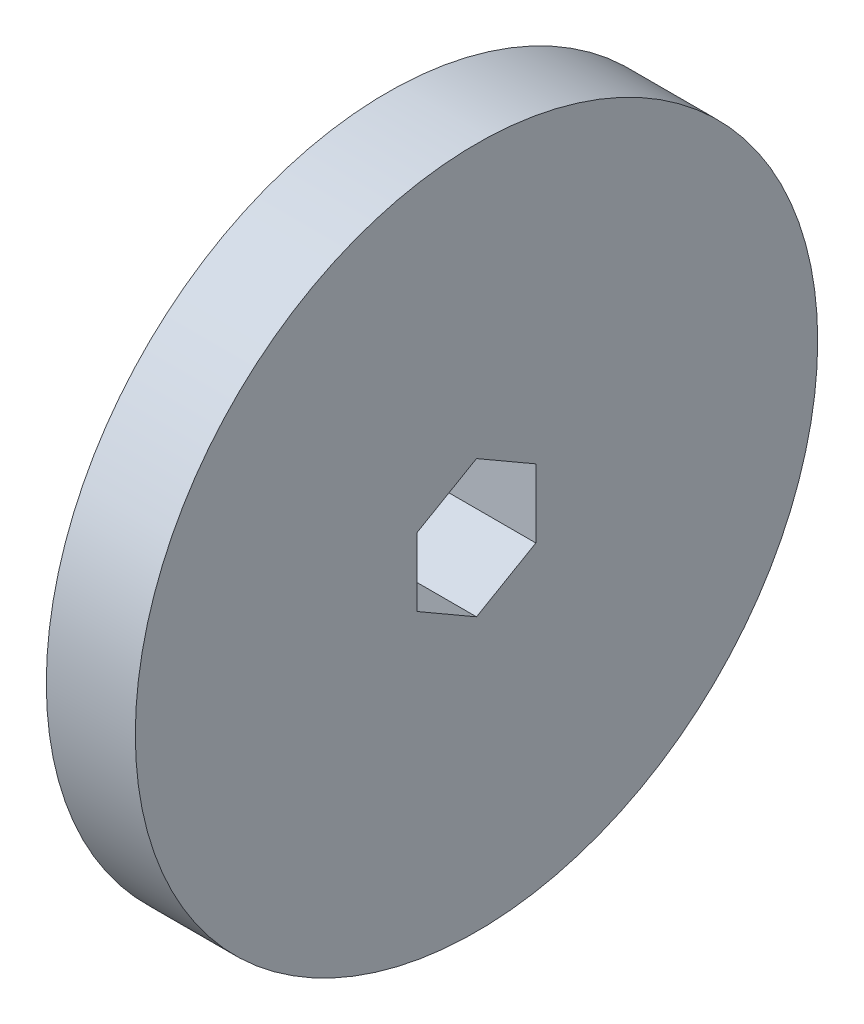
ISO-10303-21;
HEADER;
FILE_DESCRIPTION(('STEP AP214'),'2;1');
FILE_NAME('part.step','',(''),(''),'','','');
FILE_SCHEMA(('AUTOMOTIVE_DESIGN { 1 0 10303 214 1 1 1 1 }'));
ENDSEC;
DATA;
#1=APPLICATION_CONTEXT('core data for automotive mechanical design processes');
#2=APPLICATION_PROTOCOL_DEFINITION('international standard','automotive_design',2000,#1);
#3=PRODUCT_CONTEXT('',#1,'mechanical');
#4=PRODUCT('Part','Part','',(#3));
#5=PRODUCT_RELATED_PRODUCT_CATEGORY('part','',(#4));
#6=PRODUCT_DEFINITION_FORMATION('','',#4);
#7=PRODUCT_DEFINITION_CONTEXT('part definition',#1,'design');
#8=PRODUCT_DEFINITION('design','',#6,#7);
#9=PRODUCT_DEFINITION_SHAPE('','',#8);
#10=(LENGTH_UNIT() NAMED_UNIT(*) SI_UNIT(.MILLI.,.METRE.));
#11=(NAMED_UNIT(*) PLANE_ANGLE_UNIT() SI_UNIT($,.RADIAN.));
#12=(NAMED_UNIT(*) SI_UNIT($,.STERADIAN.) SOLID_ANGLE_UNIT());
#13=UNCERTAINTY_MEASURE_WITH_UNIT(LENGTH_MEASURE(1.E-05),#10,'distance_accuracy_value','');
#14=(GEOMETRIC_REPRESENTATION_CONTEXT(3) GLOBAL_UNCERTAINTY_ASSIGNED_CONTEXT((#13)) GLOBAL_UNIT_ASSIGNED_CONTEXT((#10,
#11,#12)) REPRESENTATION_CONTEXT('',''));
#15=CARTESIAN_POINT('',(0.,0.,0.));
#16=DIRECTION('',(0.,0.,1.));
#17=DIRECTION('',(1.,0.,0.));
#18=AXIS2_PLACEMENT_3D('',#15,#16,#17);
#19=CARTESIAN_POINT('',(4.7625,0.,0.));
#20=DIRECTION('',(1.,0.,0.));
#21=DIRECTION('',(0.,0.,-1.));
#22=AXIS2_PLACEMENT_3D('',#19,#20,#21);
#23=PLANE('',#22);
#24=CARTESIAN_POINT('',(4.7625,0.,0.));
#25=DIRECTION('',(1.,0.,0.));
#26=DIRECTION('',(0.,0.,-1.));
#27=AXIS2_PLACEMENT_3D('',#24,#25,#26);
#28=CIRCLE('',#27,36.5125);
#29=CARTESIAN_POINT('',(4.7625,0.,-36.5125));
#30=VERTEX_POINT('',#29);
#31=EDGE_CURVE('E11',#30,#30,#28,.T.);
#32=ORIENTED_EDGE('',*,*,#31,.T.);
#33=EDGE_LOOP('',(#32));
#34=FACE_BOUND('',#33,.T.);
#35=DIRECTION('',(0.,-0.5,0.866025403784439));
#36=VECTOR('',#35,1.);
#37=CARTESIAN_POINT('',(4.7625,7.33234841870825,0.));
#38=LINE('',#37,#36);
#39=CARTESIAN_POINT('',(4.7625,7.33234841870825,0.));
#40=VERTEX_POINT('',#39);
#41=CARTESIAN_POINT('',(4.7625,3.66617420935412,6.35));
#42=VERTEX_POINT('',#41);
#43=EDGE_CURVE('E94',#40,#42,#38,.T.);
#44=ORIENTED_EDGE('',*,*,#43,.F.);
#45=DIRECTION('',(0.,0.5,0.866025403784439));
#46=VECTOR('',#45,1.);
#47=CARTESIAN_POINT('',(4.7625,3.66617420935413,-6.34999999999999));
#48=LINE('',#47,#46);
#49=CARTESIAN_POINT('',(4.7625,3.66617420935413,-6.34999999999999));
#50=VERTEX_POINT('',#49);
#51=EDGE_CURVE('E86',#50,#40,#48,.T.);
#52=ORIENTED_EDGE('',*,*,#51,.F.);
#53=DIRECTION('',(0.,1.,0.));
#54=VECTOR('',#53,1.);
#55=CARTESIAN_POINT('',(4.7625,-3.66617420935412,-6.35));
#56=LINE('',#55,#54);
#57=CARTESIAN_POINT('',(4.7625,-3.66617420935412,-6.35));
#58=VERTEX_POINT('',#57);
#59=EDGE_CURVE('E114',#58,#50,#56,.T.);
#60=ORIENTED_EDGE('',*,*,#59,.F.);
#61=DIRECTION('',(0.,0.5,-0.866025403784439));
#62=VECTOR('',#61,1.);
#63=CARTESIAN_POINT('',(4.7625,-7.33234841870824,0.));
#64=LINE('',#63,#62);
#65=CARTESIAN_POINT('',(4.7625,-7.33234841870824,0.));
#66=VERTEX_POINT('',#65);
#67=EDGE_CURVE('E112',#66,#58,#64,.T.);
#68=ORIENTED_EDGE('',*,*,#67,.F.);
#69=DIRECTION('',(0.,-0.5,-0.866025403784439));
#70=VECTOR('',#69,1.);
#71=CARTESIAN_POINT('',(4.7625,-3.66617420935412,6.35));
#72=LINE('',#71,#70);
#73=CARTESIAN_POINT('',(4.7625,-3.66617420935412,6.35));
#74=VERTEX_POINT('',#73);
#75=EDGE_CURVE('E108',#74,#66,#72,.T.);
#76=ORIENTED_EDGE('',*,*,#75,.F.);
#77=DIRECTION('',(0.,-1.,0.));
#78=VECTOR('',#77,1.);
#79=CARTESIAN_POINT('',(4.7625,3.66617420935412,6.35));
#80=LINE('',#79,#78);
#81=EDGE_CURVE('E106',#42,#74,#80,.T.);
#82=ORIENTED_EDGE('',*,*,#81,.F.);
#83=EDGE_LOOP('',(#44,#52,#60,#68,#76,#82));
#84=FACE_BOUND('',#83,.T.);
#85=ADVANCED_FACE('F33',(#34,#84),#23,.T.);
#86=CARTESIAN_POINT('',(-4.7625,0.,0.));
#87=DIRECTION('',(1.,0.,0.));
#88=DIRECTION('',(0.,0.,-1.));
#89=AXIS2_PLACEMENT_3D('',#86,#87,#88);
#90=PLANE('',#89);
#91=CARTESIAN_POINT('',(-4.7625,0.,0.));
#92=DIRECTION('',(1.,0.,0.));
#93=DIRECTION('',(0.,0.,-1.));
#94=AXIS2_PLACEMENT_3D('',#91,#92,#93);
#95=CIRCLE('',#94,36.5125);
#96=CARTESIAN_POINT('',(-4.7625,0.,-36.5125));
#97=VERTEX_POINT('',#96);
#98=EDGE_CURVE('E37',#97,#97,#95,.T.);
#99=ORIENTED_EDGE('',*,*,#98,.F.);
#100=EDGE_LOOP('',(#99));
#101=FACE_BOUND('',#100,.T.);
#102=DIRECTION('',(0.,0.5,0.866025403784439));
#103=VECTOR('',#102,1.);
#104=CARTESIAN_POINT('',(-4.7625,3.66617420935413,-6.34999999999999));
#105=LINE('',#104,#103);
#106=CARTESIAN_POINT('',(-4.7625,3.66617420935413,-6.34999999999999));
#107=VERTEX_POINT('',#106);
#108=CARTESIAN_POINT('',(-4.7625,7.33234841870825,0.));
#109=VERTEX_POINT('',#108);
#110=EDGE_CURVE('E56',#107,#109,#105,.T.);
#111=ORIENTED_EDGE('',*,*,#110,.T.);
#112=DIRECTION('',(0.,-0.5,0.866025403784439));
#113=VECTOR('',#112,1.);
#114=CARTESIAN_POINT('',(-4.7625,7.33234841870825,0.));
#115=LINE('',#114,#113);
#116=CARTESIAN_POINT('',(-4.7625,3.66617420935412,6.35));
#117=VERTEX_POINT('',#116);
#118=EDGE_CURVE('E101',#109,#117,#115,.T.);
#119=ORIENTED_EDGE('',*,*,#118,.T.);
#120=DIRECTION('',(0.,-1.,0.));
#121=VECTOR('',#120,1.);
#122=CARTESIAN_POINT('',(-4.7625,3.66617420935412,6.35));
#123=LINE('',#122,#121);
#124=CARTESIAN_POINT('',(-4.7625,-3.66617420935412,6.35));
#125=VERTEX_POINT('',#124);
#126=EDGE_CURVE('E118',#117,#125,#123,.T.);
#127=ORIENTED_EDGE('',*,*,#126,.T.);
#128=DIRECTION('',(0.,-0.5,-0.866025403784439));
#129=VECTOR('',#128,1.);
#130=CARTESIAN_POINT('',(-4.7625,-3.66617420935412,6.35));
#131=LINE('',#130,#129);
#132=CARTESIAN_POINT('',(-4.7625,-7.33234841870824,0.));
#133=VERTEX_POINT('',#132);
#134=EDGE_CURVE('E121',#125,#133,#131,.T.);
#135=ORIENTED_EDGE('',*,*,#134,.T.);
#136=DIRECTION('',(0.,0.5,-0.866025403784439));
#137=VECTOR('',#136,1.);
#138=CARTESIAN_POINT('',(-4.7625,-7.33234841870824,0.));
#139=LINE('',#138,#137);
#140=CARTESIAN_POINT('',(-4.7625,-3.66617420935412,-6.35));
#141=VERTEX_POINT('',#140);
#142=EDGE_CURVE('E124',#133,#141,#139,.T.);
#143=ORIENTED_EDGE('',*,*,#142,.T.);
#144=DIRECTION('',(0.,1.,0.));
#145=VECTOR('',#144,1.);
#146=CARTESIAN_POINT('',(-4.7625,-3.66617420935412,-6.35));
#147=LINE('',#146,#145);
#148=EDGE_CURVE('E95',#141,#107,#147,.T.);
#149=ORIENTED_EDGE('',*,*,#148,.T.);
#150=EDGE_LOOP('',(#111,#119,#127,#135,#143,#149));
#151=FACE_BOUND('',#150,.T.);
#152=ADVANCED_FACE('F141',(#101,#151),#90,.F.);
#153=CARTESIAN_POINT('',(4.7625,0.,0.));
#154=DIRECTION('',(-1.,0.,0.));
#155=DIRECTION('',(0.,0.,1.));
#156=AXIS2_PLACEMENT_3D('',#153,#154,#155);
#157=CYLINDRICAL_SURFACE('',#156,36.5125);
#158=ORIENTED_EDGE('',*,*,#31,.F.);
#159=EDGE_LOOP('',(#158));
#160=FACE_BOUND('',#159,.T.);
#161=ORIENTED_EDGE('',*,*,#98,.T.);
#162=EDGE_LOOP('',(#161));
#163=FACE_BOUND('',#162,.T.);
#164=ADVANCED_FACE('F35',(#160,#163),#157,.T.);
#165=CARTESIAN_POINT('',(4.7625,3.66617420935413,-6.34999999999999));
#166=DIRECTION('',(0.,-0.866025403784439,0.5));
#167=DIRECTION('',(0.,-0.5,-0.866025403784439));
#168=AXIS2_PLACEMENT_3D('',#165,#166,#167);
#169=PLANE('',#168);
#170=ORIENTED_EDGE('',*,*,#110,.F.);
#171=DIRECTION('',(-1.,0.,0.));
#172=VECTOR('',#171,1.);
#173=CARTESIAN_POINT('',(4.7625,3.66617420935413,-6.34999999999999));
#174=LINE('',#173,#172);
#175=EDGE_CURVE('E90',#50,#107,#174,.T.);
#176=ORIENTED_EDGE('',*,*,#175,.F.);
#177=ORIENTED_EDGE('',*,*,#51,.T.);
#178=DIRECTION('',(-1.,0.,0.));
#179=VECTOR('',#178,1.);
#180=CARTESIAN_POINT('',(4.7625,7.33234841870825,0.));
#181=LINE('',#180,#179);
#182=EDGE_CURVE('E89',#40,#109,#181,.T.);
#183=ORIENTED_EDGE('',*,*,#182,.T.);
#184=EDGE_LOOP('',(#170,#176,#177,#183));
#185=FACE_BOUND('',#184,.T.);
#186=ADVANCED_FACE('F88',(#185),#169,.T.);
#187=CARTESIAN_POINT('',(4.7625,7.33234841870825,0.));
#188=DIRECTION('',(0.,-0.866025403784439,-0.5));
#189=DIRECTION('',(0.,0.5,-0.866025403784439));
#190=AXIS2_PLACEMENT_3D('',#187,#188,#189);
#191=PLANE('',#190);
#192=ORIENTED_EDGE('',*,*,#118,.F.);
#193=ORIENTED_EDGE('',*,*,#182,.F.);
#194=ORIENTED_EDGE('',*,*,#43,.T.);
#195=DIRECTION('',(-1.,0.,0.));
#196=VECTOR('',#195,1.);
#197=CARTESIAN_POINT('',(4.7625,3.66617420935412,6.35));
#198=LINE('',#197,#196);
#199=EDGE_CURVE('E102',#42,#117,#198,.T.);
#200=ORIENTED_EDGE('',*,*,#199,.T.);
#201=EDGE_LOOP('',(#192,#193,#194,#200));
#202=FACE_BOUND('',#201,.T.);
#203=ADVANCED_FACE('F98',(#202),#191,.T.);
#204=CARTESIAN_POINT('',(4.7625,3.66617420935412,6.35));
#205=DIRECTION('',(0.,0.,-1.));
#206=DIRECTION('',(0.,1.,0.));
#207=AXIS2_PLACEMENT_3D('',#204,#205,#206);
#208=PLANE('',#207);
#209=ORIENTED_EDGE('',*,*,#126,.F.);
#210=ORIENTED_EDGE('',*,*,#199,.F.);
#211=ORIENTED_EDGE('',*,*,#81,.T.);
#212=DIRECTION('',(-1.,0.,0.));
#213=VECTOR('',#212,1.);
#214=CARTESIAN_POINT('',(4.7625,-3.66617420935412,6.35));
#215=LINE('',#214,#213);
#216=EDGE_CURVE('E133',#74,#125,#215,.T.);
#217=ORIENTED_EDGE('',*,*,#216,.T.);
#218=EDGE_LOOP('',(#209,#210,#211,#217));
#219=FACE_BOUND('',#218,.T.);
#220=ADVANCED_FACE('F137',(#219),#208,.T.);
#221=CARTESIAN_POINT('',(4.7625,-3.66617420935412,6.35));
#222=DIRECTION('',(0.,0.866025403784439,-0.5));
#223=DIRECTION('',(0.,0.5,0.866025403784439));
#224=AXIS2_PLACEMENT_3D('',#221,#222,#223);
#225=PLANE('',#224);
#226=ORIENTED_EDGE('',*,*,#134,.F.);
#227=ORIENTED_EDGE('',*,*,#216,.F.);
#228=ORIENTED_EDGE('',*,*,#75,.T.);
#229=DIRECTION('',(-1.,0.,0.));
#230=VECTOR('',#229,1.);
#231=CARTESIAN_POINT('',(4.7625,-7.33234841870824,0.));
#232=LINE('',#231,#230);
#233=EDGE_CURVE('E131',#66,#133,#232,.T.);
#234=ORIENTED_EDGE('',*,*,#233,.T.);
#235=EDGE_LOOP('',(#226,#227,#228,#234));
#236=FACE_BOUND('',#235,.T.);
#237=ADVANCED_FACE('F149',(#236),#225,.T.);
#238=CARTESIAN_POINT('',(4.7625,-7.33234841870824,0.));
#239=DIRECTION('',(0.,0.866025403784439,0.5));
#240=DIRECTION('',(0.,-0.5,0.866025403784439));
#241=AXIS2_PLACEMENT_3D('',#238,#239,#240);
#242=PLANE('',#241);
#243=ORIENTED_EDGE('',*,*,#142,.F.);
#244=ORIENTED_EDGE('',*,*,#233,.F.);
#245=ORIENTED_EDGE('',*,*,#67,.T.);
#246=DIRECTION('',(-1.,0.,0.));
#247=VECTOR('',#246,1.);
#248=CARTESIAN_POINT('',(4.7625,-3.66617420935412,-6.35));
#249=LINE('',#248,#247);
#250=EDGE_CURVE('E48',#58,#141,#249,.T.);
#251=ORIENTED_EDGE('',*,*,#250,.T.);
#252=EDGE_LOOP('',(#243,#244,#245,#251));
#253=FACE_BOUND('',#252,.T.);
#254=ADVANCED_FACE('F147',(#253),#242,.T.);
#255=CARTESIAN_POINT('',(4.7625,-3.66617420935412,-6.35));
#256=DIRECTION('',(0.,0.,1.));
#257=DIRECTION('',(0.,-1.,0.));
#258=AXIS2_PLACEMENT_3D('',#255,#256,#257);
#259=PLANE('',#258);
#260=ORIENTED_EDGE('',*,*,#148,.F.);
#261=ORIENTED_EDGE('',*,*,#250,.F.);
#262=ORIENTED_EDGE('',*,*,#59,.T.);
#263=ORIENTED_EDGE('',*,*,#175,.T.);
#264=EDGE_LOOP('',(#260,#261,#262,#263));
#265=FACE_BOUND('',#264,.T.);
#266=ADVANCED_FACE('F143',(#265),#259,.T.);
#267=CLOSED_SHELL('',(#85,#152,#164,#186,#203,#220,#237,#254,#266));
#268=MANIFOLD_SOLID_BREP('B2',#267);
#269=ADVANCED_BREP_SHAPE_REPRESENTATION('',(#18,#268),#14);
#270=SHAPE_DEFINITION_REPRESENTATION(#9,#269);
ENDSEC;
END-ISO-10303-21;
